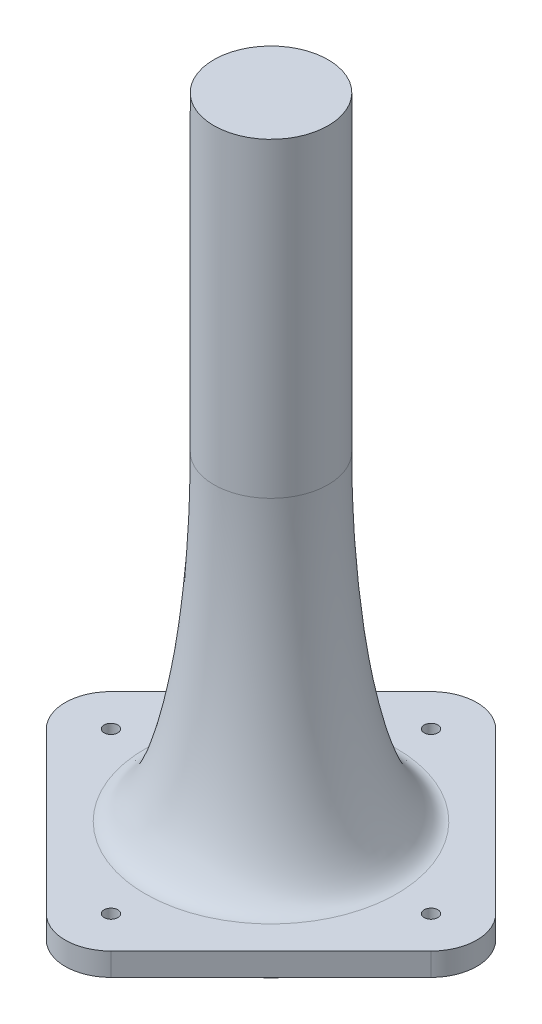
ISO-10303-21;
HEADER;
FILE_DESCRIPTION(('STEP AP214'),'2;1');
FILE_NAME('part.step','',(''),(''),'','','');
FILE_SCHEMA(('AUTOMOTIVE_DESIGN { 1 0 10303 214 1 1 1 1 }'));
ENDSEC;
DATA;
#1=APPLICATION_CONTEXT('core data for automotive mechanical design processes');
#2=APPLICATION_PROTOCOL_DEFINITION('international standard','automotive_design',2000,#1);
#3=PRODUCT_CONTEXT('',#1,'mechanical');
#4=PRODUCT('Part','Part','',(#3));
#5=PRODUCT_RELATED_PRODUCT_CATEGORY('part','',(#4));
#6=PRODUCT_DEFINITION_FORMATION('','',#4);
#7=PRODUCT_DEFINITION_CONTEXT('part definition',#1,'design');
#8=PRODUCT_DEFINITION('design','',#6,#7);
#9=PRODUCT_DEFINITION_SHAPE('','',#8);
#10=(LENGTH_UNIT() NAMED_UNIT(*) SI_UNIT(.MILLI.,.METRE.));
#11=(NAMED_UNIT(*) PLANE_ANGLE_UNIT() SI_UNIT($,.RADIAN.));
#12=(NAMED_UNIT(*) SI_UNIT($,.STERADIAN.) SOLID_ANGLE_UNIT());
#13=UNCERTAINTY_MEASURE_WITH_UNIT(LENGTH_MEASURE(1.E-05),#10,'distance_accuracy_value','');
#14=(GEOMETRIC_REPRESENTATION_CONTEXT(3) GLOBAL_UNCERTAINTY_ASSIGNED_CONTEXT((#13)) GLOBAL_UNIT_ASSIGNED_CONTEXT((#10,
#11,#12)) REPRESENTATION_CONTEXT('',''));
#15=CARTESIAN_POINT('',(0.,0.,0.));
#16=DIRECTION('',(0.,0.,1.));
#17=DIRECTION('',(1.,0.,0.));
#18=AXIS2_PLACEMENT_3D('',#15,#16,#17);
#19=CARTESIAN_POINT('',(0.,150.,0.));
#20=DIRECTION('',(0.,-1.,0.));
#21=DIRECTION('',(0.,0.,-1.));
#22=AXIS2_PLACEMENT_3D('',#19,#20,#21);
#23=CYLINDRICAL_SURFACE('',#22,12.5);
#24=CARTESIAN_POINT('',(0.,82.,12.5));
#25=CARTESIAN_POINT('',(-1.63624617338405,82.,12.5));
#26=CARTESIAN_POINT('',(-3.27184855482428,82.,12.1746584582159));
#27=CARTESIAN_POINT('',(-6.295237254303,82.,10.9223298545663));
#28=CARTESIAN_POINT('',(-7.6818339999409,82.,9.99583552972279));
#29=CARTESIAN_POINT('',(-9.99583552972284,82.,7.68183399994084));
#30=CARTESIAN_POINT('',(-10.9223298545666,82.,6.29523725430228));
#31=CARTESIAN_POINT('',(-12.1746584582156,82.,3.27184855482493));
#32=CARTESIAN_POINT('',(-12.5,82.,1.6362461733841));
#33=CARTESIAN_POINT('',(-12.5,82.,-1.63624617338406));
#34=CARTESIAN_POINT('',(-12.1746584582152,82.,-3.27184855482607));
#35=CARTESIAN_POINT('',(-10.922329854567,82.,-6.29523725430121));
#36=CARTESIAN_POINT('',(-9.99583552971962,82.,-7.68183399994407));
#37=CARTESIAN_POINT('',(-7.68183399994408,82.,-9.99583552971961));
#38=CARTESIAN_POINT('',(-6.29523725430312,82.,-10.9223298545662));
#39=CARTESIAN_POINT('',(-3.27184855482409,82.,-12.174658458216));
#40=CARTESIAN_POINT('',(-1.63624617338408,82.,-12.5));
#41=CARTESIAN_POINT('',(1.63624617338408,82.,-12.5));
#42=CARTESIAN_POINT('',(3.27184855482367,82.,-12.1746584582162));
#43=CARTESIAN_POINT('',(6.29523725430361,82.,-10.922329854566));
#44=CARTESIAN_POINT('',(7.68183399994251,82.,-9.99583552972118));
#45=CARTESIAN_POINT('',(9.99583552972117,82.,-7.68183399994252));
#46=CARTESIAN_POINT('',(10.9223298545662,82.,-6.29523725430304));
#47=CARTESIAN_POINT('',(12.1746584582159,82.,-3.27184855482421));
#48=CARTESIAN_POINT('',(12.5,82.,-1.63624617338408));
#49=CARTESIAN_POINT('',(12.5,82.,1.63624617338408));
#50=CARTESIAN_POINT('',(12.1746584582161,82.,3.27184855482375));
#51=CARTESIAN_POINT('',(10.9223298545661,82.,6.29523725430349));
#52=CARTESIAN_POINT('',(9.99583552972356,82.,7.68183399994013));
#53=CARTESIAN_POINT('',(7.68183399994013,82.,9.99583552972356));
#54=CARTESIAN_POINT('',(6.29523725430262,82.,10.9223298545664));
#55=CARTESIAN_POINT('',(3.27184855482462,82.,12.1746584582158));
#56=CARTESIAN_POINT('',(1.63624617338405,82.,12.5));
#57=CARTESIAN_POINT('',(0.,82.,12.5));
#58=(BOUNDED_CURVE() B_SPLINE_CURVE(3,(#24,#25,#26,#27,#28,#29,#30,#31,#32,#33,#34,#35,#36,#37,
#38,#39,#40,#41,#42,#43,#44,#45,#46,#47,#48,#49,#50,#51,#52,#53,#54,#55,#56,#57),.UNSPECIFIED.,
.T.,.F.) B_SPLINE_CURVE_WITH_KNOTS((4,2,2,2,2,2,2,2,2,2,2,2,2,2,2,2,4),(0.,0.392699081698725,
0.785398163397448,1.17809724509617,1.5707963267949,1.96349540849362,2.35619449019234,
2.74889357189107,3.14159265358979,3.53429173528852,3.92699081698724,4.31968989868597,
4.71238898038469,5.10508806208341,5.49778714378214,5.89048622548086,6.28318530717959),
.UNSPECIFIED.) CURVE() GEOMETRIC_REPRESENTATION_ITEM() RATIONAL_B_SPLINE_CURVE((1.,1.,1.,1.,1.,
1.,1.,1.,1.,1.,1.,1.,1.,1.,1.,1.,1.,1.,1.,1.,1.,1.,1.,1.,1.,1.,1.,1.,1.,1.,1.,1.,1.,1.)) REPRESENTATION_ITEM(''));
#59=CARTESIAN_POINT('',(0.,82.,12.5));
#60=VERTEX_POINT('',#59);
#61=EDGE_CURVE('E59',#60,#60,#58,.F.);
#62=ORIENTED_EDGE('',*,*,#61,.T.);
#63=EDGE_LOOP('',(#62));
#64=FACE_BOUND('',#63,.T.);
#65=CARTESIAN_POINT('',(0.,150.,0.));
#66=DIRECTION('',(0.,1.,0.));
#67=DIRECTION('',(0.,0.,1.));
#68=AXIS2_PLACEMENT_3D('',#65,#66,#67);
#69=CIRCLE('',#68,12.5);
#70=CARTESIAN_POINT('',(0.,150.,12.5));
#71=VERTEX_POINT('',#70);
#72=EDGE_CURVE('E185',#71,#71,#69,.T.);
#73=ORIENTED_EDGE('',*,*,#72,.F.);
#74=EDGE_LOOP('',(#73));
#75=FACE_BOUND('',#74,.T.);
#76=ADVANCED_FACE('F44',(#64,#75),#23,.T.);
#77=CARTESIAN_POINT('',(0.,150.,0.));
#78=DIRECTION('',(0.,1.,0.));
#79=DIRECTION('',(0.,0.,1.));
#80=AXIS2_PLACEMENT_3D('',#77,#78,#79);
#81=PLANE('',#80);
#82=ORIENTED_EDGE('',*,*,#72,.T.);
#83=EDGE_LOOP('',(#82));
#84=FACE_BOUND('',#83,.T.);
#85=ADVANCED_FACE('F204',(#84),#81,.T.);
#86=CARTESIAN_POINT('',(0.,12.,-35.));
#87=DIRECTION('',(0.,1.,0.));
#88=DIRECTION('',(0.,0.,1.));
#89=AXIS2_PLACEMENT_3D('',#86,#87,#88);
#90=PLANE('',#89);
#91=CARTESIAN_POINT('',(0.,12.,27.5));
#92=CARTESIAN_POINT('',(3.59974158144491,12.,27.5));
#93=CARTESIAN_POINT('',(7.19806682061292,12.,26.7842486080721));
#94=CARTESIAN_POINT('',(13.849521959467,12.,24.0291256800486));
#95=CARTESIAN_POINT('',(16.9000347998683,12.,21.9908381653918));
#96=CARTESIAN_POINT('',(21.9908381653918,12.,16.9000347998683));
#97=CARTESIAN_POINT('',(24.0291256800486,12.,13.849521959467));
#98=CARTESIAN_POINT('',(26.7842486080721,12.,7.19806682061291));
#99=CARTESIAN_POINT('',(27.5,12.,3.59974158144497));
#100=CARTESIAN_POINT('',(27.5,12.,-3.59974158144497));
#101=CARTESIAN_POINT('',(26.7842486080846,12.,-7.19806682061293));
#102=CARTESIAN_POINT('',(24.0291256800361,12.,-13.849521959467));
#103=CARTESIAN_POINT('',(21.9908381653888,12.,-16.9000347998714));
#104=CARTESIAN_POINT('',(16.9000347998713,12.,-21.9908381653888));
#105=CARTESIAN_POINT('',(13.8495219594686,12.,-24.0291256800445));
#106=CARTESIAN_POINT('',(7.19806682061141,12.,-26.7842486080762));
#107=CARTESIAN_POINT('',(3.59974158144498,12.,-27.5));
#108=CARTESIAN_POINT('',(-3.59974158144497,12.,-27.5));
#109=CARTESIAN_POINT('',(-7.19806682061446,12.,-26.7842486080762));
#110=CARTESIAN_POINT('',(-13.8495219594654,12.,-24.0291256800446));
#111=CARTESIAN_POINT('',(-16.9000347998714,12.,-21.9908381653888));
#112=CARTESIAN_POINT('',(-21.9908381653888,12.,-16.9000347998713));
#113=CARTESIAN_POINT('',(-24.0291256800464,12.,-13.8495219594655));
#114=CARTESIAN_POINT('',(-26.7842486080743,12.,-7.19806682061451));
#115=CARTESIAN_POINT('',(-27.5,12.,-3.59974158144493));
#116=CARTESIAN_POINT('',(-27.5,12.,3.59974158144502));
#117=CARTESIAN_POINT('',(-26.7842486080743,12.,7.19806682061443));
#118=CARTESIAN_POINT('',(-24.0291256800465,12.,13.8495219594654));
#119=CARTESIAN_POINT('',(-21.9908381653949,12.,16.9000347998714));
#120=CARTESIAN_POINT('',(-16.9000347998653,12.,21.9908381653886));
#121=CARTESIAN_POINT('',(-13.8495219594686,12.,24.0291256800464));
#122=CARTESIAN_POINT('',(-7.19806682061139,12.,26.7842486080743));
#123=CARTESIAN_POINT('',(-3.59974158144491,12.,27.5));
#124=CARTESIAN_POINT('',(0.,12.,27.5));
#125=(BOUNDED_CURVE() B_SPLINE_CURVE(3,(#91,#92,#93,#94,#95,#96,#97,#98,#99,#100,#101,#102,#103,
#104,#105,#106,#107,#108,#109,#110,#111,#112,#113,#114,#115,#116,#117,#118,#119,#120,#121,#122,
#123,#124),.UNSPECIFIED.,.T.,.F.) B_SPLINE_CURVE_WITH_KNOTS((4,2,2,2,2,2,2,2,2,2,2,2,2,2,2,2,4),
(0.,0.392699081698724,0.785398163397448,1.17809724509617,1.5707963267949,1.96349540849362,
2.35619449019234,2.74889357189107,3.14159265358979,3.53429173528852,3.92699081698724,
4.31968989868597,4.71238898038469,5.10508806208341,5.49778714378214,5.89048622548086,
6.28318530717959),
.UNSPECIFIED.) CURVE() GEOMETRIC_REPRESENTATION_ITEM() RATIONAL_B_SPLINE_CURVE((1.,1.,1.,1.,1.,
1.,1.,1.,1.,1.,1.,1.,1.,1.,1.,1.,1.,1.,1.,1.,1.,1.,1.,1.,1.,1.,1.,1.,1.,1.,1.,1.,1.,1.)) REPRESENTATION_ITEM(''));
#126=CARTESIAN_POINT('',(0.,12.,27.5));
#127=VERTEX_POINT('',#126);
#128=EDGE_CURVE('E12',#127,#127,#125,.F.);
#129=ORIENTED_EDGE('',*,*,#128,.T.);
#130=EDGE_LOOP('',(#129));
#131=FACE_BOUND('',#130,.T.);
#132=CARTESIAN_POINT('',(35.,12.,0.));
#133=DIRECTION('',(0.,1.,0.));
#134=DIRECTION('',(0.,0.,1.));
#135=AXIS2_PLACEMENT_3D('',#132,#133,#134);
#136=CIRCLE('',#135,1.5);
#137=CARTESIAN_POINT('',(35.,12.,1.5));
#138=VERTEX_POINT('',#137);
#139=EDGE_CURVE('E276',#138,#138,#136,.T.);
#140=ORIENTED_EDGE('',*,*,#139,.F.);
#141=EDGE_LOOP('',(#140));
#142=FACE_BOUND('',#141,.T.);
#143=CARTESIAN_POINT('',(-35.,12.,0.));
#144=DIRECTION('',(0.,1.,0.));
#145=DIRECTION('',(0.,0.,1.));
#146=AXIS2_PLACEMENT_3D('',#143,#144,#145);
#147=CIRCLE('',#146,1.5);
#148=CARTESIAN_POINT('',(-35.,12.,1.50000000000001));
#149=VERTEX_POINT('',#148);
#150=EDGE_CURVE('E153',#149,#149,#147,.T.);
#151=ORIENTED_EDGE('',*,*,#150,.F.);
#152=EDGE_LOOP('',(#151));
#153=FACE_BOUND('',#152,.T.);
#154=CARTESIAN_POINT('',(0.,12.,-35.));
#155=DIRECTION('',(0.,1.,0.));
#156=DIRECTION('',(0.,0.,1.));
#157=AXIS2_PLACEMENT_3D('',#154,#155,#156);
#158=CIRCLE('',#157,10.);
#159=CARTESIAN_POINT('',(7.07106781186547,12.,-42.0710678118655));
#160=VERTEX_POINT('',#159);
#161=CARTESIAN_POINT('',(-7.07106781186549,12.,-42.0710678118655));
#162=VERTEX_POINT('',#161);
#163=EDGE_CURVE('E164',#160,#162,#158,.T.);
#164=ORIENTED_EDGE('',*,*,#163,.T.);
#165=DIRECTION('',(-0.707106781186547,0.,0.707106781186548));
#166=VECTOR('',#165,1.);
#167=CARTESIAN_POINT('',(-7.07106781186549,12.,-42.0710678118655));
#168=LINE('',#167,#166);
#169=CARTESIAN_POINT('',(-42.0710678118655,12.,-7.07106781186547));
#170=VERTEX_POINT('',#169);
#171=EDGE_CURVE('E111',#162,#170,#168,.T.);
#172=ORIENTED_EDGE('',*,*,#171,.T.);
#173=CARTESIAN_POINT('',(-35.,12.,0.));
#174=DIRECTION('',(0.,1.,0.));
#175=DIRECTION('',(0.,0.,1.));
#176=AXIS2_PLACEMENT_3D('',#173,#174,#175);
#177=CIRCLE('',#176,10.);
#178=CARTESIAN_POINT('',(-42.0710678118655,12.,7.07106781186549));
#179=VERTEX_POINT('',#178);
#180=EDGE_CURVE('E291',#170,#179,#177,.T.);
#181=ORIENTED_EDGE('',*,*,#180,.T.);
#182=DIRECTION('',(0.707106781186548,0.,0.707106781186548));
#183=VECTOR('',#182,1.);
#184=CARTESIAN_POINT('',(-42.0710678118655,12.,7.07106781186549));
#185=LINE('',#184,#183);
#186=CARTESIAN_POINT('',(-7.07106781186548,12.,42.0710678118655));
#187=VERTEX_POINT('',#186);
#188=EDGE_CURVE('E293',#179,#187,#185,.T.);
#189=ORIENTED_EDGE('',*,*,#188,.T.);
#190=CARTESIAN_POINT('',(0.,12.,35.));
#191=DIRECTION('',(0.,1.,0.));
#192=DIRECTION('',(0.,0.,1.));
#193=AXIS2_PLACEMENT_3D('',#190,#191,#192);
#194=CIRCLE('',#193,9.99999999999999);
#195=CARTESIAN_POINT('',(7.07106781186546,12.,42.0710678118655));
#196=VERTEX_POINT('',#195);
#197=EDGE_CURVE('E131',#187,#196,#194,.T.);
#198=ORIENTED_EDGE('',*,*,#197,.T.);
#199=DIRECTION('',(0.707106781186547,0.,-0.707106781186548));
#200=VECTOR('',#199,1.);
#201=CARTESIAN_POINT('',(42.0710678118655,12.,7.07106781186549));
#202=LINE('',#201,#200);
#203=CARTESIAN_POINT('',(42.0710678118655,12.,7.07106781186549));
#204=VERTEX_POINT('',#203);
#205=EDGE_CURVE('E124',#196,#204,#202,.T.);
#206=ORIENTED_EDGE('',*,*,#205,.T.);
#207=CARTESIAN_POINT('',(35.,12.,0.));
#208=DIRECTION('',(0.,1.,0.));
#209=DIRECTION('',(0.,0.,1.));
#210=AXIS2_PLACEMENT_3D('',#207,#208,#209);
#211=CIRCLE('',#210,10.);
#212=CARTESIAN_POINT('',(42.0710678118655,12.,-7.07106781186549));
#213=VERTEX_POINT('',#212);
#214=EDGE_CURVE('E129',#204,#213,#211,.T.);
#215=ORIENTED_EDGE('',*,*,#214,.T.);
#216=DIRECTION('',(-0.707106781186548,0.,-0.707106781186547));
#217=VECTOR('',#216,1.);
#218=CARTESIAN_POINT('',(7.07106781186547,12.,-42.0710678118655));
#219=LINE('',#218,#217);
#220=EDGE_CURVE('E67',#213,#160,#219,.T.);
#221=ORIENTED_EDGE('',*,*,#220,.T.);
#222=EDGE_LOOP('',(#164,#172,#181,#189,#198,#206,#215,#221));
#223=FACE_BOUND('',#222,.T.);
#224=CARTESIAN_POINT('',(0.,12.,-35.));
#225=DIRECTION('',(0.,1.,0.));
#226=DIRECTION('',(0.,0.,1.));
#227=AXIS2_PLACEMENT_3D('',#224,#225,#226);
#228=CIRCLE('',#227,1.5);
#229=CARTESIAN_POINT('',(0.,12.,-33.5));
#230=VERTEX_POINT('',#229);
#231=EDGE_CURVE('E283',#230,#230,#228,.T.);
#232=ORIENTED_EDGE('',*,*,#231,.F.);
#233=EDGE_LOOP('',(#232));
#234=FACE_BOUND('',#233,.T.);
#235=CARTESIAN_POINT('',(0.,12.,35.));
#236=DIRECTION('',(0.,1.,0.));
#237=DIRECTION('',(0.,0.,1.));
#238=AXIS2_PLACEMENT_3D('',#235,#236,#237);
#239=CIRCLE('',#238,1.5);
#240=CARTESIAN_POINT('',(0.,12.,36.5));
#241=VERTEX_POINT('',#240);
#242=EDGE_CURVE('E319',#241,#241,#239,.T.);
#243=ORIENTED_EDGE('',*,*,#242,.F.);
#244=EDGE_LOOP('',(#243));
#245=FACE_BOUND('',#244,.T.);
#246=ADVANCED_FACE('F126',(#131,#142,#153,#223,#234,#245),#90,.T.);
#247=CARTESIAN_POINT('',(0.,7.,-35.));
#248=DIRECTION('',(0.,1.,0.));
#249=DIRECTION('',(0.,0.,1.));
#250=AXIS2_PLACEMENT_3D('',#247,#248,#249);
#251=PLANE('',#250);
#252=CARTESIAN_POINT('',(0.,7.,0.));
#253=DIRECTION('',(0.,1.,0.));
#254=DIRECTION('',(0.,0.,1.));
#255=AXIS2_PLACEMENT_3D('',#252,#253,#254);
#256=CIRCLE('',#255,25.);
#257=CARTESIAN_POINT('',(0.,7.,25.));
#258=VERTEX_POINT('',#257);
#259=EDGE_CURVE('E179',#258,#258,#256,.F.);
#260=ORIENTED_EDGE('',*,*,#259,.F.);
#261=EDGE_LOOP('',(#260));
#262=FACE_BOUND('',#261,.T.);
#263=CARTESIAN_POINT('',(0.,7.,-35.));
#264=DIRECTION('',(0.,1.,0.));
#265=DIRECTION('',(0.,0.,1.));
#266=AXIS2_PLACEMENT_3D('',#263,#264,#265);
#267=CIRCLE('',#266,10.);
#268=CARTESIAN_POINT('',(7.07106781186547,7.,-42.0710678118655));
#269=VERTEX_POINT('',#268);
#270=CARTESIAN_POINT('',(-7.07106781186549,7.,-42.0710678118655));
#271=VERTEX_POINT('',#270);
#272=EDGE_CURVE('E149',#269,#271,#267,.T.);
#273=ORIENTED_EDGE('',*,*,#272,.F.);
#274=DIRECTION('',(-0.707106781186548,0.,-0.707106781186547));
#275=VECTOR('',#274,1.);
#276=CARTESIAN_POINT('',(7.07106781186547,7.,-42.0710678118655));
#277=LINE('',#276,#275);
#278=CARTESIAN_POINT('',(42.0710678118655,7.,-7.07106781186549));
#279=VERTEX_POINT('',#278);
#280=EDGE_CURVE('E102',#279,#269,#277,.T.);
#281=ORIENTED_EDGE('',*,*,#280,.F.);
#282=CARTESIAN_POINT('',(35.,7.,0.));
#283=DIRECTION('',(0.,1.,0.));
#284=DIRECTION('',(0.,0.,1.));
#285=AXIS2_PLACEMENT_3D('',#282,#283,#284);
#286=CIRCLE('',#285,10.);
#287=CARTESIAN_POINT('',(42.0710678118655,7.,7.07106781186549));
#288=VERTEX_POINT('',#287);
#289=EDGE_CURVE('E96',#288,#279,#286,.T.);
#290=ORIENTED_EDGE('',*,*,#289,.F.);
#291=DIRECTION('',(0.707106781186547,0.,-0.707106781186548));
#292=VECTOR('',#291,1.);
#293=CARTESIAN_POINT('',(42.0710678118655,7.,7.07106781186549));
#294=LINE('',#293,#292);
#295=CARTESIAN_POINT('',(7.07106781186546,7.,42.0710678118655));
#296=VERTEX_POINT('',#295);
#297=EDGE_CURVE('E139',#296,#288,#294,.T.);
#298=ORIENTED_EDGE('',*,*,#297,.F.);
#299=CARTESIAN_POINT('',(0.,7.,35.));
#300=DIRECTION('',(0.,1.,0.));
#301=DIRECTION('',(0.,0.,1.));
#302=AXIS2_PLACEMENT_3D('',#299,#300,#301);
#303=CIRCLE('',#302,9.99999999999999);
#304=CARTESIAN_POINT('',(-7.07106781186548,7.,42.0710678118655));
#305=VERTEX_POINT('',#304);
#306=EDGE_CURVE('E159',#305,#296,#303,.T.);
#307=ORIENTED_EDGE('',*,*,#306,.F.);
#308=DIRECTION('',(0.707106781186548,0.,0.707106781186548));
#309=VECTOR('',#308,1.);
#310=CARTESIAN_POINT('',(-42.0710678118655,7.,7.07106781186549));
#311=LINE('',#310,#309);
#312=CARTESIAN_POINT('',(-42.0710678118655,7.,7.07106781186549));
#313=VERTEX_POINT('',#312);
#314=EDGE_CURVE('E157',#313,#305,#311,.T.);
#315=ORIENTED_EDGE('',*,*,#314,.F.);
#316=CARTESIAN_POINT('',(-35.,7.,0.));
#317=DIRECTION('',(0.,1.,0.));
#318=DIRECTION('',(0.,0.,1.));
#319=AXIS2_PLACEMENT_3D('',#316,#317,#318);
#320=CIRCLE('',#319,10.);
#321=CARTESIAN_POINT('',(-42.0710678118655,7.,-7.07106781186547));
#322=VERTEX_POINT('',#321);
#323=EDGE_CURVE('E155',#322,#313,#320,.T.);
#324=ORIENTED_EDGE('',*,*,#323,.F.);
#325=DIRECTION('',(-0.707106781186547,0.,0.707106781186548));
#326=VECTOR('',#325,1.);
#327=CARTESIAN_POINT('',(-7.07106781186549,7.,-42.0710678118655));
#328=LINE('',#327,#326);
#329=EDGE_CURVE('E152',#271,#322,#328,.T.);
#330=ORIENTED_EDGE('',*,*,#329,.F.);
#331=EDGE_LOOP('',(#273,#281,#290,#298,#307,#315,#324,#330));
#332=FACE_BOUND('',#331,.T.);
#333=CARTESIAN_POINT('',(-35.,7.,0.));
#334=DIRECTION('',(0.,1.,0.));
#335=DIRECTION('',(0.,0.,1.));
#336=AXIS2_PLACEMENT_3D('',#333,#334,#335);
#337=CIRCLE('',#336,1.5);
#338=CARTESIAN_POINT('',(-35.,7.,1.50000000000001));
#339=VERTEX_POINT('',#338);
#340=EDGE_CURVE('E280',#339,#339,#337,.T.);
#341=ORIENTED_EDGE('',*,*,#340,.T.);
#342=EDGE_LOOP('',(#341));
#343=FACE_BOUND('',#342,.T.);
#344=CARTESIAN_POINT('',(0.,7.,-35.));
#345=DIRECTION('',(0.,1.,0.));
#346=DIRECTION('',(0.,0.,1.));
#347=AXIS2_PLACEMENT_3D('',#344,#345,#346);
#348=CIRCLE('',#347,1.5);
#349=CARTESIAN_POINT('',(0.,7.,-33.5));
#350=VERTEX_POINT('',#349);
#351=EDGE_CURVE('E286',#350,#350,#348,.T.);
#352=ORIENTED_EDGE('',*,*,#351,.T.);
#353=EDGE_LOOP('',(#352));
#354=FACE_BOUND('',#353,.T.);
#355=CARTESIAN_POINT('',(35.,7.,0.));
#356=DIRECTION('',(0.,1.,0.));
#357=DIRECTION('',(0.,0.,1.));
#358=AXIS2_PLACEMENT_3D('',#355,#356,#357);
#359=CIRCLE('',#358,1.5);
#360=CARTESIAN_POINT('',(35.,7.,1.5));
#361=VERTEX_POINT('',#360);
#362=EDGE_CURVE('E314',#361,#361,#359,.T.);
#363=ORIENTED_EDGE('',*,*,#362,.T.);
#364=EDGE_LOOP('',(#363));
#365=FACE_BOUND('',#364,.T.);
#366=CARTESIAN_POINT('',(0.,7.,35.));
#367=DIRECTION('',(0.,1.,0.));
#368=DIRECTION('',(0.,0.,1.));
#369=AXIS2_PLACEMENT_3D('',#366,#367,#368);
#370=CIRCLE('',#369,1.5);
#371=CARTESIAN_POINT('',(0.,7.,36.5));
#372=VERTEX_POINT('',#371);
#373=EDGE_CURVE('E317',#372,#372,#370,.T.);
#374=ORIENTED_EDGE('',*,*,#373,.T.);
#375=EDGE_LOOP('',(#374));
#376=FACE_BOUND('',#375,.T.);
#377=ADVANCED_FACE('F221',(#262,#332,#343,#354,#365,#376),#251,.F.);
#378=CARTESIAN_POINT('',(0.,12.,-35.));
#379=DIRECTION('',(0.,-1.,0.));
#380=DIRECTION('',(0.,0.,-1.));
#381=AXIS2_PLACEMENT_3D('',#378,#379,#380);
#382=CYLINDRICAL_SURFACE('',#381,10.);
#383=ORIENTED_EDGE('',*,*,#272,.T.);
#384=DIRECTION('',(0.,-1.,0.));
#385=VECTOR('',#384,1.);
#386=CARTESIAN_POINT('',(-7.07106781186549,12.,-42.0710678118655));
#387=LINE('',#386,#385);
#388=EDGE_CURVE('E177',#162,#271,#387,.T.);
#389=ORIENTED_EDGE('',*,*,#388,.F.);
#390=ORIENTED_EDGE('',*,*,#163,.F.);
#391=DIRECTION('',(0.,-1.,0.));
#392=VECTOR('',#391,1.);
#393=CARTESIAN_POINT('',(7.07106781186547,12.,-42.0710678118655));
#394=LINE('',#393,#392);
#395=EDGE_CURVE('E145',#160,#269,#394,.T.);
#396=ORIENTED_EDGE('',*,*,#395,.T.);
#397=EDGE_LOOP('',(#383,#389,#390,#396));
#398=FACE_BOUND('',#397,.T.);
#399=ADVANCED_FACE('F217',(#398),#382,.T.);
#400=CARTESIAN_POINT('',(-7.07106781186549,12.,-42.0710678118655));
#401=DIRECTION('',(0.707106781186548,0.,0.707106781186547));
#402=DIRECTION('',(0.707106781186547,0.,-0.707106781186548));
#403=AXIS2_PLACEMENT_3D('',#400,#401,#402);
#404=PLANE('',#403);
#405=ORIENTED_EDGE('',*,*,#329,.T.);
#406=DIRECTION('',(0.,-1.,0.));
#407=VECTOR('',#406,1.);
#408=CARTESIAN_POINT('',(-42.0710678118655,12.,-7.07106781186547));
#409=LINE('',#408,#407);
#410=EDGE_CURVE('E174',#170,#322,#409,.T.);
#411=ORIENTED_EDGE('',*,*,#410,.F.);
#412=ORIENTED_EDGE('',*,*,#171,.F.);
#413=ORIENTED_EDGE('',*,*,#388,.T.);
#414=EDGE_LOOP('',(#405,#411,#412,#413));
#415=FACE_BOUND('',#414,.T.);
#416=ADVANCED_FACE('F220',(#415),#404,.F.);
#417=CARTESIAN_POINT('',(-35.,12.,0.));
#418=DIRECTION('',(0.,-1.,0.));
#419=DIRECTION('',(0.,0.,-1.));
#420=AXIS2_PLACEMENT_3D('',#417,#418,#419);
#421=CYLINDRICAL_SURFACE('',#420,10.);
#422=ORIENTED_EDGE('',*,*,#323,.T.);
#423=DIRECTION('',(0.,-1.,0.));
#424=VECTOR('',#423,1.);
#425=CARTESIAN_POINT('',(-42.0710678118655,12.,7.07106781186549));
#426=LINE('',#425,#424);
#427=EDGE_CURVE('E171',#179,#313,#426,.T.);
#428=ORIENTED_EDGE('',*,*,#427,.F.);
#429=ORIENTED_EDGE('',*,*,#180,.F.);
#430=ORIENTED_EDGE('',*,*,#410,.T.);
#431=EDGE_LOOP('',(#422,#428,#429,#430));
#432=FACE_BOUND('',#431,.T.);
#433=ADVANCED_FACE('F225',(#432),#421,.T.);
#434=CARTESIAN_POINT('',(-42.0710678118655,12.,7.07106781186549));
#435=DIRECTION('',(0.707106781186548,0.,-0.707106781186548));
#436=DIRECTION('',(-0.707106781186548,0.,-0.707106781186548));
#437=AXIS2_PLACEMENT_3D('',#434,#435,#436);
#438=PLANE('',#437);
#439=ORIENTED_EDGE('',*,*,#314,.T.);
#440=DIRECTION('',(0.,-1.,0.));
#441=VECTOR('',#440,1.);
#442=CARTESIAN_POINT('',(-7.07106781186548,12.,42.0710678118655));
#443=LINE('',#442,#441);
#444=EDGE_CURVE('E168',#187,#305,#443,.T.);
#445=ORIENTED_EDGE('',*,*,#444,.F.);
#446=ORIENTED_EDGE('',*,*,#188,.F.);
#447=ORIENTED_EDGE('',*,*,#427,.T.);
#448=EDGE_LOOP('',(#439,#445,#446,#447));
#449=FACE_BOUND('',#448,.T.);
#450=ADVANCED_FACE('F228',(#449),#438,.F.);
#451=CARTESIAN_POINT('',(0.,12.,35.));
#452=DIRECTION('',(0.,-1.,0.));
#453=DIRECTION('',(0.,0.,-1.));
#454=AXIS2_PLACEMENT_3D('',#451,#452,#453);
#455=CYLINDRICAL_SURFACE('',#454,9.99999999999999);
#456=ORIENTED_EDGE('',*,*,#306,.T.);
#457=DIRECTION('',(0.,-1.,0.));
#458=VECTOR('',#457,1.);
#459=CARTESIAN_POINT('',(7.07106781186546,12.,42.0710678118655));
#460=LINE('',#459,#458);
#461=EDGE_CURVE('E140',#196,#296,#460,.T.);
#462=ORIENTED_EDGE('',*,*,#461,.F.);
#463=ORIENTED_EDGE('',*,*,#197,.F.);
#464=ORIENTED_EDGE('',*,*,#444,.T.);
#465=EDGE_LOOP('',(#456,#462,#463,#464));
#466=FACE_BOUND('',#465,.T.);
#467=ADVANCED_FACE('F232',(#466),#455,.T.);
#468=CARTESIAN_POINT('',(42.0710678118655,12.,7.07106781186549));
#469=DIRECTION('',(-0.707106781186548,0.,-0.707106781186547));
#470=DIRECTION('',(-0.707106781186547,0.,0.707106781186548));
#471=AXIS2_PLACEMENT_3D('',#468,#469,#470);
#472=PLANE('',#471);
#473=ORIENTED_EDGE('',*,*,#297,.T.);
#474=DIRECTION('',(0.,-1.,0.));
#475=VECTOR('',#474,1.);
#476=CARTESIAN_POINT('',(42.0710678118655,12.,7.07106781186549));
#477=LINE('',#476,#475);
#478=EDGE_CURVE('E136',#204,#288,#477,.T.);
#479=ORIENTED_EDGE('',*,*,#478,.F.);
#480=ORIENTED_EDGE('',*,*,#205,.F.);
#481=ORIENTED_EDGE('',*,*,#461,.T.);
#482=EDGE_LOOP('',(#473,#479,#480,#481));
#483=FACE_BOUND('',#482,.T.);
#484=ADVANCED_FACE('F137',(#483),#472,.F.);
#485=CARTESIAN_POINT('',(35.,12.,0.));
#486=DIRECTION('',(0.,-1.,0.));
#487=DIRECTION('',(0.,0.,-1.));
#488=AXIS2_PLACEMENT_3D('',#485,#486,#487);
#489=CYLINDRICAL_SURFACE('',#488,10.);
#490=ORIENTED_EDGE('',*,*,#289,.T.);
#491=DIRECTION('',(0.,-1.,0.));
#492=VECTOR('',#491,1.);
#493=CARTESIAN_POINT('',(42.0710678118655,12.,-7.07106781186549));
#494=LINE('',#493,#492);
#495=EDGE_CURVE('E141',#213,#279,#494,.T.);
#496=ORIENTED_EDGE('',*,*,#495,.F.);
#497=ORIENTED_EDGE('',*,*,#214,.F.);
#498=ORIENTED_EDGE('',*,*,#478,.T.);
#499=EDGE_LOOP('',(#490,#496,#497,#498));
#500=FACE_BOUND('',#499,.T.);
#501=ADVANCED_FACE('F143',(#500),#489,.T.);
#502=CARTESIAN_POINT('',(7.07106781186547,12.,-42.0710678118655));
#503=DIRECTION('',(-0.707106781186547,0.,0.707106781186548));
#504=DIRECTION('',(0.707106781186548,0.,0.707106781186547));
#505=AXIS2_PLACEMENT_3D('',#502,#503,#504);
#506=PLANE('',#505);
#507=ORIENTED_EDGE('',*,*,#280,.T.);
#508=ORIENTED_EDGE('',*,*,#395,.F.);
#509=ORIENTED_EDGE('',*,*,#220,.F.);
#510=ORIENTED_EDGE('',*,*,#495,.T.);
#511=EDGE_LOOP('',(#507,#508,#509,#510));
#512=FACE_BOUND('',#511,.T.);
#513=ADVANCED_FACE('F241',(#512),#506,.F.);
#514=CARTESIAN_POINT('',(-35.,12.,0.));
#515=DIRECTION('',(0.,-1.,0.));
#516=DIRECTION('',(0.,0.,-1.));
#517=AXIS2_PLACEMENT_3D('',#514,#515,#516);
#518=CYLINDRICAL_SURFACE('',#517,1.5);
#519=ORIENTED_EDGE('',*,*,#150,.T.);
#520=EDGE_LOOP('',(#519));
#521=FACE_BOUND('',#520,.T.);
#522=ORIENTED_EDGE('',*,*,#340,.F.);
#523=EDGE_LOOP('',(#522));
#524=FACE_BOUND('',#523,.T.);
#525=ADVANCED_FACE('F244',(#521,#524),#518,.F.);
#526=CARTESIAN_POINT('',(0.,12.,-35.));
#527=DIRECTION('',(0.,-1.,0.));
#528=DIRECTION('',(0.,0.,-1.));
#529=AXIS2_PLACEMENT_3D('',#526,#527,#528);
#530=CYLINDRICAL_SURFACE('',#529,1.5);
#531=ORIENTED_EDGE('',*,*,#231,.T.);
#532=EDGE_LOOP('',(#531));
#533=FACE_BOUND('',#532,.T.);
#534=ORIENTED_EDGE('',*,*,#351,.F.);
#535=EDGE_LOOP('',(#534));
#536=FACE_BOUND('',#535,.T.);
#537=ADVANCED_FACE('F328',(#533,#536),#530,.F.);
#538=CARTESIAN_POINT('',(35.,12.,0.));
#539=DIRECTION('',(0.,-1.,0.));
#540=DIRECTION('',(0.,0.,-1.));
#541=AXIS2_PLACEMENT_3D('',#538,#539,#540);
#542=CYLINDRICAL_SURFACE('',#541,1.5);
#543=ORIENTED_EDGE('',*,*,#139,.T.);
#544=EDGE_LOOP('',(#543));
#545=FACE_BOUND('',#544,.T.);
#546=ORIENTED_EDGE('',*,*,#362,.F.);
#547=EDGE_LOOP('',(#546));
#548=FACE_BOUND('',#547,.T.);
#549=ADVANCED_FACE('F334',(#545,#548),#542,.F.);
#550=CARTESIAN_POINT('',(0.,12.,35.));
#551=DIRECTION('',(0.,-1.,0.));
#552=DIRECTION('',(0.,0.,-1.));
#553=AXIS2_PLACEMENT_3D('',#550,#551,#552);
#554=CYLINDRICAL_SURFACE('',#553,1.5);
#555=ORIENTED_EDGE('',*,*,#242,.T.);
#556=EDGE_LOOP('',(#555));
#557=FACE_BOUND('',#556,.T.);
#558=ORIENTED_EDGE('',*,*,#373,.F.);
#559=EDGE_LOOP('',(#558));
#560=FACE_BOUND('',#559,.T.);
#561=ADVANCED_FACE('F209',(#557,#560),#554,.F.);
#562=CARTESIAN_POINT('',(0.,0.,0.));
#563=DIRECTION('',(0.,1.,0.));
#564=DIRECTION('',(0.,0.,1.));
#565=AXIS2_PLACEMENT_3D('',#562,#563,#564);
#566=PLANE('',#565);
#567=CARTESIAN_POINT('',(0.,0.,0.));
#568=DIRECTION('',(0.,-1.,0.));
#569=DIRECTION('',(0.,0.,-1.));
#570=AXIS2_PLACEMENT_3D('',#567,#568,#569);
#571=CIRCLE('',#570,25.);
#572=CARTESIAN_POINT('',(0.,0.,-25.));
#573=VERTEX_POINT('',#572);
#574=EDGE_CURVE('E182',#573,#573,#571,.T.);
#575=ORIENTED_EDGE('',*,*,#574,.T.);
#576=EDGE_LOOP('',(#575));
#577=FACE_BOUND('',#576,.T.);
#578=ADVANCED_FACE('F205',(#577),#566,.F.);
#579=CARTESIAN_POINT('',(0.,7.,0.));
#580=DIRECTION('',(0.,-1.,0.));
#581=DIRECTION('',(0.,0.,-1.));
#582=AXIS2_PLACEMENT_3D('',#579,#580,#581);
#583=CYLINDRICAL_SURFACE('',#582,25.);
#584=ORIENTED_EDGE('',*,*,#259,.T.);
#585=EDGE_LOOP('',(#584));
#586=FACE_BOUND('',#585,.T.);
#587=ORIENTED_EDGE('',*,*,#574,.F.);
#588=EDGE_LOOP('',(#587));
#589=FACE_BOUND('',#588,.T.);
#590=ADVANCED_FACE('F208',(#586,#589),#583,.T.);
#591=CARTESIAN_POINT('',(0.,82.,12.5));
#592=CARTESIAN_POINT('',(1.63624617338405,82.,12.5));
#593=CARTESIAN_POINT('',(3.27184855482462,82.,12.1746584582158));
#594=CARTESIAN_POINT('',(6.29523725430262,82.,10.9223298545664));
#595=CARTESIAN_POINT('',(7.68183399994013,82.,9.99583552972356));
#596=CARTESIAN_POINT('',(9.99583552972356,82.,7.68183399994013));
#597=CARTESIAN_POINT('',(10.9223298545661,82.,6.29523725430349));
#598=CARTESIAN_POINT('',(12.1746584582161,82.,3.27184855482375));
#599=CARTESIAN_POINT('',(12.5,82.,1.63624617338408));
#600=CARTESIAN_POINT('',(12.5,82.,-1.63624617338408));
#601=CARTESIAN_POINT('',(12.1746584582159,82.,-3.27184855482421));
#602=CARTESIAN_POINT('',(10.9223298545662,82.,-6.29523725430304));
#603=CARTESIAN_POINT('',(9.99583552972117,82.,-7.68183399994252));
#604=CARTESIAN_POINT('',(7.68183399994251,82.,-9.99583552972118));
#605=CARTESIAN_POINT('',(6.29523725430361,82.,-10.922329854566));
#606=CARTESIAN_POINT('',(3.27184855482367,82.,-12.1746584582162));
#607=CARTESIAN_POINT('',(1.63624617338408,82.,-12.5));
#608=CARTESIAN_POINT('',(-1.63624617338408,82.,-12.5));
#609=CARTESIAN_POINT('',(-3.27184855482409,82.,-12.174658458216));
#610=CARTESIAN_POINT('',(-6.29523725430312,82.,-10.9223298545662));
#611=CARTESIAN_POINT('',(-7.68183399994408,82.,-9.99583552971961));
#612=CARTESIAN_POINT('',(-9.99583552971962,82.,-7.68183399994407));
#613=CARTESIAN_POINT('',(-10.922329854567,82.,-6.29523725430121));
#614=CARTESIAN_POINT('',(-12.1746584582152,82.,-3.27184855482607));
#615=CARTESIAN_POINT('',(-12.5,82.,-1.63624617338406));
#616=CARTESIAN_POINT('',(-12.5,82.,1.6362461733841));
#617=CARTESIAN_POINT('',(-12.1746584582156,82.,3.27184855482493));
#618=CARTESIAN_POINT('',(-10.9223298545666,82.,6.29523725430228));
#619=CARTESIAN_POINT('',(-9.99583552972284,82.,7.68183399994084));
#620=CARTESIAN_POINT('',(-7.6818339999409,82.,9.99583552972279));
#621=CARTESIAN_POINT('',(-6.295237254303,82.,10.9223298545663));
#622=CARTESIAN_POINT('',(-3.27184855482428,82.,12.1746584582159));
#623=CARTESIAN_POINT('',(-1.63624617338405,82.,12.5));
#624=CARTESIAN_POINT('',(0.,82.,12.5));
#625=CARTESIAN_POINT('',(0.,12.,12.5));
#626=CARTESIAN_POINT('',(1.63624617338405,12.,12.5000000000125));
#627=CARTESIAN_POINT('',(3.2718485548286,12.,12.1746584582078));
#628=CARTESIAN_POINT('',(6.29523725429865,12.,10.9223298545744));
#629=CARTESIAN_POINT('',(7.68183399994013,12.,9.99583552972356));
#630=CARTESIAN_POINT('',(9.99583552972356,12.,7.68183399994013));
#631=CARTESIAN_POINT('',(10.922329854565,12.,6.29523725429865));
#632=CARTESIAN_POINT('',(12.1746584582172,12.,3.2718485548286));
#633=CARTESIAN_POINT('',(12.5,12.,1.63624617338408));
#634=CARTESIAN_POINT('',(12.5,12.,-1.63624617338408));
#635=CARTESIAN_POINT('',(12.1746584582234,12.,-3.27184855483328));
#636=CARTESIAN_POINT('',(10.9223298545588,12.,-6.29523725429397));
#637=CARTESIAN_POINT('',(9.99583552972585,12.,-7.68183399994408));
#638=CARTESIAN_POINT('',(7.68183399993783,12.,-9.99583552971962));
#639=CARTESIAN_POINT('',(6.29523725430504,12.,-10.9223298545688));
#640=CARTESIAN_POINT('',(3.27184855482223,12.,-12.1746584582133));
#641=CARTESIAN_POINT('',(1.63624617338408,12.,-12.5));
#642=CARTESIAN_POINT('',(-1.63624617338408,12.,-12.5));
#643=CARTESIAN_POINT('',(-3.27184855482689,12.,-12.1746584582196));
#644=CARTESIAN_POINT('',(-6.29523725430033,12.,-10.9223298545626));
#645=CARTESIAN_POINT('',(-7.68183399994096,12.,-9.99583552971961));
#646=CARTESIAN_POINT('',(-9.99583552972274,12.,-7.68183399994407));
#647=CARTESIAN_POINT('',(-10.9223298545674,12.,-6.29523725430321));
#648=CARTESIAN_POINT('',(-12.1746584582147,12.,-3.27184855482406));
#649=CARTESIAN_POINT('',(-12.5,12.,-1.63624617338406));
#650=CARTESIAN_POINT('',(-12.5,12.,1.6362461733841));
#651=CARTESIAN_POINT('',(-12.1746584582241,12.,3.27184855482403));
#652=CARTESIAN_POINT('',(-10.9223298545581,12.,6.29523725430317));
#653=CARTESIAN_POINT('',(-9.99583552972441,12.,7.68183399993929));
#654=CARTESIAN_POINT('',(-7.68183399993934,12.,9.99583552972435));
#655=CARTESIAN_POINT('',(-6.29523725430945,12.,10.9223298545674));
#656=CARTESIAN_POINT('',(-3.27184855481782,12.,12.1746584582147));
#657=CARTESIAN_POINT('',(-1.63624617338405,12.,12.4999999999875));
#658=CARTESIAN_POINT('',(0.,12.,12.5));
#659=CARTESIAN_POINT('',(0.,12.,27.5));
#660=CARTESIAN_POINT('',(3.59974158144491,12.,27.5));
#661=CARTESIAN_POINT('',(7.19806682061292,12.,26.7842486080721));
#662=CARTESIAN_POINT('',(13.849521959467,12.,24.0291256800486));
#663=CARTESIAN_POINT('',(16.9000347998683,12.,21.9908381653918));
#664=CARTESIAN_POINT('',(21.9908381653918,12.,16.9000347998683));
#665=CARTESIAN_POINT('',(24.0291256800486,12.,13.849521959467));
#666=CARTESIAN_POINT('',(26.7842486080721,12.,7.19806682061291));
#667=CARTESIAN_POINT('',(27.5,12.,3.59974158144497));
#668=CARTESIAN_POINT('',(27.5,12.,-3.59974158144497));
#669=CARTESIAN_POINT('',(26.7842486080846,12.,-7.19806682061293));
#670=CARTESIAN_POINT('',(24.0291256800361,12.,-13.849521959467));
#671=CARTESIAN_POINT('',(21.9908381653888,12.,-16.9000347998714));
#672=CARTESIAN_POINT('',(16.9000347998713,12.,-21.9908381653888));
#673=CARTESIAN_POINT('',(13.8495219594686,12.,-24.0291256800445));
#674=CARTESIAN_POINT('',(7.19806682061141,12.,-26.7842486080762));
#675=CARTESIAN_POINT('',(3.59974158144498,12.,-27.5));
#676=CARTESIAN_POINT('',(-3.59974158144497,12.,-27.5));
#677=CARTESIAN_POINT('',(-7.19806682061446,12.,-26.7842486080762));
#678=CARTESIAN_POINT('',(-13.8495219594654,12.,-24.0291256800446));
#679=CARTESIAN_POINT('',(-16.9000347998714,12.,-21.9908381653888));
#680=CARTESIAN_POINT('',(-21.9908381653888,12.,-16.9000347998713));
#681=CARTESIAN_POINT('',(-24.0291256800464,12.,-13.8495219594655));
#682=CARTESIAN_POINT('',(-26.7842486080743,12.,-7.19806682061451));
#683=CARTESIAN_POINT('',(-27.5,12.,-3.59974158144493));
#684=CARTESIAN_POINT('',(-27.5,12.,3.59974158144502));
#685=CARTESIAN_POINT('',(-26.7842486080743,12.,7.19806682061443));
#686=CARTESIAN_POINT('',(-24.0291256800465,12.,13.8495219594654));
#687=CARTESIAN_POINT('',(-21.9908381653949,12.,16.9000347998714));
#688=CARTESIAN_POINT('',(-16.9000347998653,12.,21.9908381653886));
#689=CARTESIAN_POINT('',(-13.8495219594686,12.,24.0291256800464));
#690=CARTESIAN_POINT('',(-7.19806682061139,12.,26.7842486080743));
#691=CARTESIAN_POINT('',(-3.59974158144491,12.,27.5));
#692=CARTESIAN_POINT('',(0.,12.,27.5));
#693=(BOUNDED_SURFACE() B_SPLINE_SURFACE(2,3,((#591,#592,#593,#594,#595,#596,#597,#598,#599,
#600,#601,#602,#603,#604,#605,#606,#607,#608,#609,#610,#611,#612,#613,#614,#615,#616,#617,#618,
#619,#620,#621,#622,#623,#624),(#625,#626,#627,#628,#629,#630,#631,#632,#633,#634,#635,#636,
#637,#638,#639,#640,#641,#642,#643,#644,#645,#646,#647,#648,#649,#650,#651,#652,#653,#654,#655,
#656,#657,#658),(#659,#660,#661,#662,#663,#664,#665,#666,#667,#668,#669,#670,#671,#672,#673,
#674,#675,#676,#677,#678,#679,#680,#681,#682,#683,#684,#685,#686,#687,#688,#689,#690,#691,
#692)),.UNSPECIFIED.,.F.,.T.,.F.) B_SPLINE_SURFACE_WITH_KNOTS((3,3),(4,2,2,2,2,2,2,2,2,2,2,2,2,
2,2,2,4),(0.,1.),(0.,0.392699081698724,0.785398163397448,1.17809724509617,1.5707963267949,
1.96349540849362,2.35619449019234,2.74889357189107,3.14159265358979,3.53429173528852,
3.92699081698724,4.31968989868597,4.71238898038469,5.10508806208341,5.49778714378214,
5.89048622548086,6.28318530717959),
.UNSPECIFIED.) GEOMETRIC_REPRESENTATION_ITEM() RATIONAL_B_SPLINE_SURFACE(((1.,1.,1.,1.,1.,1.,1.,
1.,1.,1.,1.,1.,1.,1.,1.,1.,1.,1.,1.,1.,1.,1.,1.,1.,1.,1.,1.,1.,1.,1.,1.,1.,1.,1.),
(0.707106781186548,0.707106781186548,0.707106781186548,0.707106781186548,0.707106781186548,
0.707106781186548,0.707106781186548,0.707106781186548,0.707106781186548,0.707106781186548,
0.707106781186548,0.707106781186548,0.707106781186548,0.707106781186548,0.707106781186548,
0.707106781186548,0.707106781186548,0.707106781186548,0.707106781186548,0.707106781186548,
0.707106781186548,0.707106781186548,0.707106781186548,0.707106781186548,0.707106781186548,
0.707106781186548,0.707106781186548,0.707106781186548,0.707106781186548,0.707106781186548,
0.707106781186548,0.707106781186548,0.707106781186548,0.707106781186548),(1.,1.,1.,1.,1.,1.,1.,
1.,1.,1.,1.,1.,1.,1.,1.,1.,1.,1.,1.,1.,1.,1.,1.,1.,1.,1.,1.,1.,1.,1.,1.,1.,1.,1.))) REPRESENTATION_ITEM('') SURFACE());
#694=ORIENTED_EDGE('',*,*,#128,.F.);
#695=EDGE_LOOP('',(#694));
#696=FACE_BOUND('',#695,.T.);
#697=ORIENTED_EDGE('',*,*,#61,.F.);
#698=EDGE_LOOP('',(#697));
#699=FACE_BOUND('',#698,.T.);
#700=ADVANCED_FACE('F47',(#696,#699),#693,.T.);
#701=CLOSED_SHELL('',(#76,#85,#246,#377,#399,#416,#433,#450,#467,#484,#501,#513,#525,#537,#549,
#561,#578,#590,#700));
#702=MANIFOLD_SOLID_BREP('B2',#701);
#703=ADVANCED_BREP_SHAPE_REPRESENTATION('',(#18,#702),#14);
#704=SHAPE_DEFINITION_REPRESENTATION(#9,#703);
ENDSEC;
END-ISO-10303-21;
